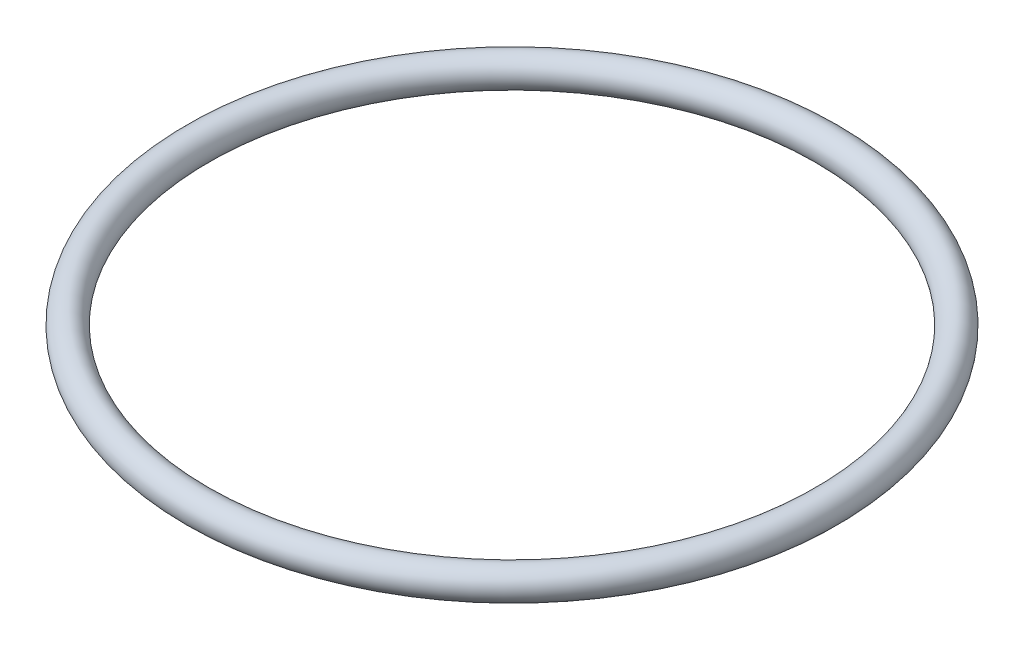
ISO-10303-21;
HEADER;
FILE_DESCRIPTION(('STEP AP214'),'2;1');
FILE_NAME('part.step','',(''),(''),'','','');
FILE_SCHEMA(('AUTOMOTIVE_DESIGN { 1 0 10303 214 1 1 1 1 }'));
ENDSEC;
DATA;
#1=APPLICATION_CONTEXT('core data for automotive mechanical design processes');
#2=APPLICATION_PROTOCOL_DEFINITION('international standard','automotive_design',2000,#1);
#3=PRODUCT_CONTEXT('',#1,'mechanical');
#4=PRODUCT('Part','Part','',(#3));
#5=PRODUCT_RELATED_PRODUCT_CATEGORY('part','',(#4));
#6=PRODUCT_DEFINITION_FORMATION('','',#4);
#7=PRODUCT_DEFINITION_CONTEXT('part definition',#1,'design');
#8=PRODUCT_DEFINITION('design','',#6,#7);
#9=PRODUCT_DEFINITION_SHAPE('','',#8);
#10=(LENGTH_UNIT() NAMED_UNIT(*) SI_UNIT(.MILLI.,.METRE.));
#11=(NAMED_UNIT(*) PLANE_ANGLE_UNIT() SI_UNIT($,.RADIAN.));
#12=(NAMED_UNIT(*) SI_UNIT($,.STERADIAN.) SOLID_ANGLE_UNIT());
#13=UNCERTAINTY_MEASURE_WITH_UNIT(LENGTH_MEASURE(1.E-05),#10,'distance_accuracy_value','');
#14=(GEOMETRIC_REPRESENTATION_CONTEXT(3) GLOBAL_UNCERTAINTY_ASSIGNED_CONTEXT((#13)) GLOBAL_UNIT_ASSIGNED_CONTEXT((#10,
#11,#12)) REPRESENTATION_CONTEXT('',''));
#15=CARTESIAN_POINT('',(0.,0.,0.));
#16=DIRECTION('',(0.,0.,1.));
#17=DIRECTION('',(1.,0.,0.));
#18=AXIS2_PLACEMENT_3D('',#15,#16,#17);
#19=CARTESIAN_POINT('',(0.,0.,0.));
#20=DIRECTION('',(0.,-1.,0.));
#21=DIRECTION('',(0.,0.,-1.));
#22=AXIS2_PLACEMENT_3D('',#19,#20,#21);
#23=TOROIDAL_SURFACE('',#22,30.75,1.5);
#24=CARTESIAN_POINT('',(0.,0.,-32.25));
#25=VERTEX_POINT('',#24);
#26=VERTEX_LOOP('',#25);
#27=FACE_BOUND('',#26,.T.);
#28=ADVANCED_FACE('F35',(#27),#23,.T.);
#29=CLOSED_SHELL('',(#28));
#30=MANIFOLD_SOLID_BREP('B2',#29);
#31=ADVANCED_BREP_SHAPE_REPRESENTATION('',(#18,#30),#14);
#32=SHAPE_DEFINITION_REPRESENTATION(#9,#31);
ENDSEC;
END-ISO-10303-21;
